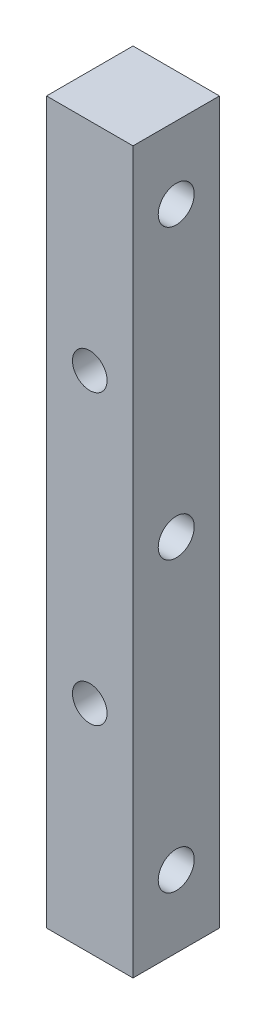
ISO-10303-21;
HEADER;
FILE_DESCRIPTION(('STEP AP214'),'2;1');
FILE_NAME('part.step','',(''),(''),'','','');
FILE_SCHEMA(('AUTOMOTIVE_DESIGN { 1 0 10303 214 1 1 1 1 }'));
ENDSEC;
DATA;
#1=APPLICATION_CONTEXT('core data for automotive mechanical design processes');
#2=APPLICATION_PROTOCOL_DEFINITION('international standard','automotive_design',2000,#1);
#3=PRODUCT_CONTEXT('',#1,'mechanical');
#4=PRODUCT('Part','Part','',(#3));
#5=PRODUCT_RELATED_PRODUCT_CATEGORY('part','',(#4));
#6=PRODUCT_DEFINITION_FORMATION('','',#4);
#7=PRODUCT_DEFINITION_CONTEXT('part definition',#1,'design');
#8=PRODUCT_DEFINITION('design','',#6,#7);
#9=PRODUCT_DEFINITION_SHAPE('','',#8);
#10=(LENGTH_UNIT() NAMED_UNIT(*) SI_UNIT(.MILLI.,.METRE.));
#11=(NAMED_UNIT(*) PLANE_ANGLE_UNIT() SI_UNIT($,.RADIAN.));
#12=(NAMED_UNIT(*) SI_UNIT($,.STERADIAN.) SOLID_ANGLE_UNIT());
#13=UNCERTAINTY_MEASURE_WITH_UNIT(LENGTH_MEASURE(1.E-05),#10,'distance_accuracy_value','');
#14=(GEOMETRIC_REPRESENTATION_CONTEXT(3) GLOBAL_UNCERTAINTY_ASSIGNED_CONTEXT((#13)) GLOBAL_UNIT_ASSIGNED_CONTEXT((#10,
#11,#12)) REPRESENTATION_CONTEXT('',''));
#15=CARTESIAN_POINT('',(0.,0.,0.));
#16=DIRECTION('',(0.,0.,1.));
#17=DIRECTION('',(1.,0.,0.));
#18=AXIS2_PLACEMENT_3D('',#15,#16,#17);
#19=CARTESIAN_POINT('',(0.,0.,6.));
#20=DIRECTION('',(1.,0.,0.));
#21=DIRECTION('',(0.,0.,-1.));
#22=AXIS2_PLACEMENT_3D('',#19,#20,#21);
#23=PLANE('',#22);
#24=CARTESIAN_POINT('',(0.,45.,3.));
#25=DIRECTION('',(-1.,0.,0.));
#26=DIRECTION('',(0.,0.,1.));
#27=AXIS2_PLACEMENT_3D('',#24,#25,#26);
#28=CIRCLE('',#27,1.25);
#29=CARTESIAN_POINT('',(0.,45.,4.25));
#30=VERTEX_POINT('',#29);
#31=EDGE_CURVE('E102',#30,#30,#28,.T.);
#32=ORIENTED_EDGE('',*,*,#31,.F.);
#33=EDGE_LOOP('',(#32));
#34=FACE_BOUND('',#33,.T.);
#35=CARTESIAN_POINT('',(0.,25.,3.));
#36=DIRECTION('',(-1.,0.,0.));
#37=DIRECTION('',(0.,0.,1.));
#38=AXIS2_PLACEMENT_3D('',#35,#36,#37);
#39=CIRCLE('',#38,1.25);
#40=CARTESIAN_POINT('',(0.,25.,4.25));
#41=VERTEX_POINT('',#40);
#42=EDGE_CURVE('E125',#41,#41,#39,.T.);
#43=ORIENTED_EDGE('',*,*,#42,.F.);
#44=EDGE_LOOP('',(#43));
#45=FACE_BOUND('',#44,.T.);
#46=CARTESIAN_POINT('',(0.,5.,3.));
#47=DIRECTION('',(-1.,0.,0.));
#48=DIRECTION('',(0.,0.,1.));
#49=AXIS2_PLACEMENT_3D('',#46,#47,#48);
#50=CIRCLE('',#49,1.25);
#51=CARTESIAN_POINT('',(0.,5.,4.25));
#52=VERTEX_POINT('',#51);
#53=EDGE_CURVE('E113',#52,#52,#50,.T.);
#54=ORIENTED_EDGE('',*,*,#53,.F.);
#55=EDGE_LOOP('',(#54));
#56=FACE_BOUND('',#55,.T.);
#57=DIRECTION('',(0.,0.,1.));
#58=VECTOR('',#57,1.);
#59=CARTESIAN_POINT('',(0.,50.,0.));
#60=LINE('',#59,#58);
#61=CARTESIAN_POINT('',(0.,50.,0.));
#62=VERTEX_POINT('',#61);
#63=CARTESIAN_POINT('',(0.,50.,6.));
#64=VERTEX_POINT('',#63);
#65=EDGE_CURVE('E138',#62,#64,#60,.T.);
#66=ORIENTED_EDGE('',*,*,#65,.F.);
#67=DIRECTION('',(0.,-1.,0.));
#68=VECTOR('',#67,1.);
#69=CARTESIAN_POINT('',(0.,0.,0.));
#70=LINE('',#69,#68);
#71=CARTESIAN_POINT('',(0.,0.,0.));
#72=VERTEX_POINT('',#71);
#73=EDGE_CURVE('E84',#62,#72,#70,.T.);
#74=ORIENTED_EDGE('',*,*,#73,.T.);
#75=DIRECTION('',(0.,0.,-1.));
#76=VECTOR('',#75,1.);
#77=CARTESIAN_POINT('',(0.,0.,6.));
#78=LINE('',#77,#76);
#79=CARTESIAN_POINT('',(0.,0.,6.));
#80=VERTEX_POINT('',#79);
#81=EDGE_CURVE('E11',#80,#72,#78,.T.);
#82=ORIENTED_EDGE('',*,*,#81,.F.);
#83=DIRECTION('',(0.,-1.,0.));
#84=VECTOR('',#83,1.);
#85=CARTESIAN_POINT('',(0.,0.,6.));
#86=LINE('',#85,#84);
#87=EDGE_CURVE('E93',#64,#80,#86,.T.);
#88=ORIENTED_EDGE('',*,*,#87,.F.);
#89=EDGE_LOOP('',(#66,#74,#82,#88));
#90=FACE_BOUND('',#89,.T.);
#91=ADVANCED_FACE('F38',(#34,#45,#56,#90),#23,.F.);
#92=CARTESIAN_POINT('',(6.00000000000001,0.,6.));
#93=DIRECTION('',(-1.,0.,0.));
#94=DIRECTION('',(0.,0.,1.));
#95=AXIS2_PLACEMENT_3D('',#92,#93,#94);
#96=PLANE('',#95);
#97=CARTESIAN_POINT('',(6.00000000000001,45.,3.));
#98=DIRECTION('',(-1.,0.,0.));
#99=DIRECTION('',(0.,0.,1.));
#100=AXIS2_PLACEMENT_3D('',#97,#98,#99);
#101=CIRCLE('',#100,1.25);
#102=CARTESIAN_POINT('',(6.00000000000001,45.,4.25));
#103=VERTEX_POINT('',#102);
#104=EDGE_CURVE('E98',#103,#103,#101,.T.);
#105=ORIENTED_EDGE('',*,*,#104,.T.);
#106=EDGE_LOOP('',(#105));
#107=FACE_BOUND('',#106,.T.);
#108=CARTESIAN_POINT('',(6.00000000000001,25.,3.));
#109=DIRECTION('',(-1.,0.,0.));
#110=DIRECTION('',(0.,0.,1.));
#111=AXIS2_PLACEMENT_3D('',#108,#109,#110);
#112=CIRCLE('',#111,1.25);
#113=CARTESIAN_POINT('',(6.00000000000001,25.,4.25));
#114=VERTEX_POINT('',#113);
#115=EDGE_CURVE('E101',#114,#114,#112,.T.);
#116=ORIENTED_EDGE('',*,*,#115,.T.);
#117=EDGE_LOOP('',(#116));
#118=FACE_BOUND('',#117,.T.);
#119=CARTESIAN_POINT('',(6.00000000000001,5.,3.));
#120=DIRECTION('',(-1.,0.,0.));
#121=DIRECTION('',(0.,0.,1.));
#122=AXIS2_PLACEMENT_3D('',#119,#120,#121);
#123=CIRCLE('',#122,1.25);
#124=CARTESIAN_POINT('',(6.00000000000001,5.,4.25));
#125=VERTEX_POINT('',#124);
#126=EDGE_CURVE('E105',#125,#125,#123,.T.);
#127=ORIENTED_EDGE('',*,*,#126,.T.);
#128=EDGE_LOOP('',(#127));
#129=FACE_BOUND('',#128,.T.);
#130=DIRECTION('',(0.,0.,-1.));
#131=VECTOR('',#130,1.);
#132=CARTESIAN_POINT('',(6.00000000000005,50.,6.));
#133=LINE('',#132,#131);
#134=CARTESIAN_POINT('',(6.00000000000005,50.,6.));
#135=VERTEX_POINT('',#134);
#136=CARTESIAN_POINT('',(6.00000000000001,50.,0.));
#137=VERTEX_POINT('',#136);
#138=EDGE_CURVE('E54',#135,#137,#133,.T.);
#139=ORIENTED_EDGE('',*,*,#138,.F.);
#140=DIRECTION('',(0.,1.,0.));
#141=VECTOR('',#140,1.);
#142=CARTESIAN_POINT('',(6.00000000000001,0.,6.));
#143=LINE('',#142,#141);
#144=CARTESIAN_POINT('',(6.00000000000001,0.,6.));
#145=VERTEX_POINT('',#144);
#146=EDGE_CURVE('E89',#145,#135,#143,.T.);
#147=ORIENTED_EDGE('',*,*,#146,.F.);
#148=DIRECTION('',(0.,0.,-1.));
#149=VECTOR('',#148,1.);
#150=CARTESIAN_POINT('',(6.00000000000001,0.,6.));
#151=LINE('',#150,#149);
#152=CARTESIAN_POINT('',(6.00000000000001,0.,0.));
#153=VERTEX_POINT('',#152);
#154=EDGE_CURVE('E46',#145,#153,#151,.T.);
#155=ORIENTED_EDGE('',*,*,#154,.T.);
#156=DIRECTION('',(0.,1.,0.));
#157=VECTOR('',#156,1.);
#158=CARTESIAN_POINT('',(6.00000000000001,0.,0.));
#159=LINE('',#158,#157);
#160=EDGE_CURVE('E83',#153,#137,#159,.T.);
#161=ORIENTED_EDGE('',*,*,#160,.T.);
#162=EDGE_LOOP('',(#139,#147,#155,#161));
#163=FACE_BOUND('',#162,.T.);
#164=ADVANCED_FACE('F88',(#107,#118,#129,#163),#96,.F.);
#165=CARTESIAN_POINT('',(0.,0.,6.));
#166=DIRECTION('',(0.,0.,-1.));
#167=DIRECTION('',(-1.,0.,0.));
#168=AXIS2_PLACEMENT_3D('',#165,#166,#167);
#169=PLANE('',#168);
#170=CARTESIAN_POINT('',(3.,35.,6.));
#171=DIRECTION('',(0.,0.,1.));
#172=DIRECTION('',(-1.,0.,0.));
#173=AXIS2_PLACEMENT_3D('',#170,#171,#172);
#174=CIRCLE('',#173,1.2);
#175=CARTESIAN_POINT('',(1.8,35.,6.));
#176=VERTEX_POINT('',#175);
#177=EDGE_CURVE('E115',#176,#176,#174,.T.);
#178=ORIENTED_EDGE('',*,*,#177,.F.);
#179=EDGE_LOOP('',(#178));
#180=FACE_BOUND('',#179,.T.);
#181=CARTESIAN_POINT('',(3.,15.,6.));
#182=DIRECTION('',(0.,0.,1.));
#183=DIRECTION('',(-1.,0.,0.));
#184=AXIS2_PLACEMENT_3D('',#181,#182,#183);
#185=CIRCLE('',#184,1.2);
#186=CARTESIAN_POINT('',(1.8,15.,6.));
#187=VERTEX_POINT('',#186);
#188=EDGE_CURVE('E109',#187,#187,#185,.T.);
#189=ORIENTED_EDGE('',*,*,#188,.F.);
#190=EDGE_LOOP('',(#189));
#191=FACE_BOUND('',#190,.T.);
#192=DIRECTION('',(1.,0.,0.));
#193=VECTOR('',#192,1.);
#194=CARTESIAN_POINT('',(0.,50.,6.));
#195=LINE('',#194,#193);
#196=EDGE_CURVE('E120',#64,#135,#195,.T.);
#197=ORIENTED_EDGE('',*,*,#196,.F.);
#198=ORIENTED_EDGE('',*,*,#87,.T.);
#199=DIRECTION('',(1.,0.,0.));
#200=VECTOR('',#199,1.);
#201=CARTESIAN_POINT('',(0.,0.,6.));
#202=LINE('',#201,#200);
#203=EDGE_CURVE('E63',#80,#145,#202,.T.);
#204=ORIENTED_EDGE('',*,*,#203,.T.);
#205=ORIENTED_EDGE('',*,*,#146,.T.);
#206=EDGE_LOOP('',(#197,#198,#204,#205));
#207=FACE_BOUND('',#206,.T.);
#208=ADVANCED_FACE('F145',(#180,#191,#207),#169,.F.);
#209=CARTESIAN_POINT('',(0.,0.,0.));
#210=DIRECTION('',(0.,0.,-1.));
#211=DIRECTION('',(-1.,0.,0.));
#212=AXIS2_PLACEMENT_3D('',#209,#210,#211);
#213=PLANE('',#212);
#214=CARTESIAN_POINT('',(3.,35.,0.));
#215=DIRECTION('',(0.,0.,-1.));
#216=DIRECTION('',(-1.,0.,0.));
#217=AXIS2_PLACEMENT_3D('',#214,#215,#216);
#218=CIRCLE('',#217,1.2);
#219=CARTESIAN_POINT('',(1.8,35.,0.));
#220=VERTEX_POINT('',#219);
#221=EDGE_CURVE('E107',#220,#220,#218,.T.);
#222=ORIENTED_EDGE('',*,*,#221,.F.);
#223=EDGE_LOOP('',(#222));
#224=FACE_BOUND('',#223,.T.);
#225=CARTESIAN_POINT('',(3.,15.,0.));
#226=DIRECTION('',(0.,0.,-1.));
#227=DIRECTION('',(-1.,0.,0.));
#228=AXIS2_PLACEMENT_3D('',#225,#226,#227);
#229=CIRCLE('',#228,1.2);
#230=CARTESIAN_POINT('',(1.8,15.,0.));
#231=VERTEX_POINT('',#230);
#232=EDGE_CURVE('E41',#231,#231,#229,.T.);
#233=ORIENTED_EDGE('',*,*,#232,.F.);
#234=EDGE_LOOP('',(#233));
#235=FACE_BOUND('',#234,.T.);
#236=ORIENTED_EDGE('',*,*,#73,.F.);
#237=DIRECTION('',(-1.,0.,0.));
#238=VECTOR('',#237,1.);
#239=CARTESIAN_POINT('',(6.00000000000005,50.,0.));
#240=LINE('',#239,#238);
#241=EDGE_CURVE('E92',#137,#62,#240,.T.);
#242=ORIENTED_EDGE('',*,*,#241,.F.);
#243=ORIENTED_EDGE('',*,*,#160,.F.);
#244=DIRECTION('',(1.,0.,0.));
#245=VECTOR('',#244,1.);
#246=CARTESIAN_POINT('',(0.,0.,0.));
#247=LINE('',#246,#245);
#248=EDGE_CURVE('E75',#72,#153,#247,.T.);
#249=ORIENTED_EDGE('',*,*,#248,.F.);
#250=EDGE_LOOP('',(#236,#242,#243,#249));
#251=FACE_BOUND('',#250,.T.);
#252=ADVANCED_FACE('F91',(#224,#235,#251),#213,.T.);
#253=CARTESIAN_POINT('',(0.,0.,6.));
#254=DIRECTION('',(0.,1.,0.));
#255=DIRECTION('',(0.,0.,1.));
#256=AXIS2_PLACEMENT_3D('',#253,#254,#255);
#257=PLANE('',#256);
#258=ORIENTED_EDGE('',*,*,#248,.T.);
#259=ORIENTED_EDGE('',*,*,#154,.F.);
#260=ORIENTED_EDGE('',*,*,#203,.F.);
#261=ORIENTED_EDGE('',*,*,#81,.T.);
#262=EDGE_LOOP('',(#258,#259,#260,#261));
#263=FACE_BOUND('',#262,.T.);
#264=ADVANCED_FACE('F77',(#263),#257,.F.);
#265=CARTESIAN_POINT('',(8.,45.,3.));
#266=DIRECTION('',(-1.,0.,0.));
#267=DIRECTION('',(0.,0.,1.));
#268=AXIS2_PLACEMENT_3D('',#265,#266,#267);
#269=CYLINDRICAL_SURFACE('',#268,1.25);
#270=ORIENTED_EDGE('',*,*,#31,.T.);
#271=EDGE_LOOP('',(#270));
#272=FACE_BOUND('',#271,.T.);
#273=ORIENTED_EDGE('',*,*,#104,.F.);
#274=EDGE_LOOP('',(#273));
#275=FACE_BOUND('',#274,.T.);
#276=ADVANCED_FACE('F184',(#272,#275),#269,.F.);
#277=CARTESIAN_POINT('',(8.,25.,3.));
#278=DIRECTION('',(-1.,0.,0.));
#279=DIRECTION('',(0.,0.,1.));
#280=AXIS2_PLACEMENT_3D('',#277,#278,#279);
#281=CYLINDRICAL_SURFACE('',#280,1.25);
#282=ORIENTED_EDGE('',*,*,#42,.T.);
#283=EDGE_LOOP('',(#282));
#284=FACE_BOUND('',#283,.T.);
#285=ORIENTED_EDGE('',*,*,#115,.F.);
#286=EDGE_LOOP('',(#285));
#287=FACE_BOUND('',#286,.T.);
#288=ADVANCED_FACE('F174',(#284,#287),#281,.F.);
#289=CARTESIAN_POINT('',(8.,5.,3.));
#290=DIRECTION('',(-1.,0.,0.));
#291=DIRECTION('',(0.,0.,1.));
#292=AXIS2_PLACEMENT_3D('',#289,#290,#291);
#293=CYLINDRICAL_SURFACE('',#292,1.25);
#294=ORIENTED_EDGE('',*,*,#53,.T.);
#295=EDGE_LOOP('',(#294));
#296=FACE_BOUND('',#295,.T.);
#297=ORIENTED_EDGE('',*,*,#126,.F.);
#298=EDGE_LOOP('',(#297));
#299=FACE_BOUND('',#298,.T.);
#300=ADVANCED_FACE('F170',(#296,#299),#293,.F.);
#301=CARTESIAN_POINT('',(3.,35.,-4.));
#302=DIRECTION('',(0.,0.,1.));
#303=DIRECTION('',(1.,0.,0.));
#304=AXIS2_PLACEMENT_3D('',#301,#302,#303);
#305=CYLINDRICAL_SURFACE('',#304,1.2);
#306=ORIENTED_EDGE('',*,*,#221,.T.);
#307=EDGE_LOOP('',(#306));
#308=FACE_BOUND('',#307,.T.);
#309=ORIENTED_EDGE('',*,*,#177,.T.);
#310=EDGE_LOOP('',(#309));
#311=FACE_BOUND('',#310,.T.);
#312=ADVANCED_FACE('F173',(#308,#311),#305,.F.);
#313=CARTESIAN_POINT('',(3.,15.,-4.));
#314=DIRECTION('',(0.,0.,1.));
#315=DIRECTION('',(1.,0.,0.));
#316=AXIS2_PLACEMENT_3D('',#313,#314,#315);
#317=CYLINDRICAL_SURFACE('',#316,1.2);
#318=ORIENTED_EDGE('',*,*,#232,.T.);
#319=EDGE_LOOP('',(#318));
#320=FACE_BOUND('',#319,.T.);
#321=ORIENTED_EDGE('',*,*,#188,.T.);
#322=EDGE_LOOP('',(#321));
#323=FACE_BOUND('',#322,.T.);
#324=ADVANCED_FACE('F182',(#320,#323),#317,.F.);
#325=CARTESIAN_POINT('',(-1.15648231731787E-13,50.,0.));
#326=DIRECTION('',(0.,1.,0.));
#327=DIRECTION('',(-1.,0.,0.));
#328=AXIS2_PLACEMENT_3D('',#325,#326,#327);
#329=PLANE('',#328);
#330=ORIENTED_EDGE('',*,*,#138,.T.);
#331=ORIENTED_EDGE('',*,*,#241,.T.);
#332=ORIENTED_EDGE('',*,*,#65,.T.);
#333=ORIENTED_EDGE('',*,*,#196,.T.);
#334=EDGE_LOOP('',(#330,#331,#332,#333));
#335=FACE_BOUND('',#334,.T.);
#336=ADVANCED_FACE('F143',(#335),#329,.T.);
#337=CLOSED_SHELL('',(#91,#164,#208,#252,#264,#276,#288,#300,#312,#324,#336));
#338=MANIFOLD_SOLID_BREP('B2',#337);
#339=ADVANCED_BREP_SHAPE_REPRESENTATION('',(#18,#338),#14);
#340=SHAPE_DEFINITION_REPRESENTATION(#9,#339);
ENDSEC;
END-ISO-10303-21;
